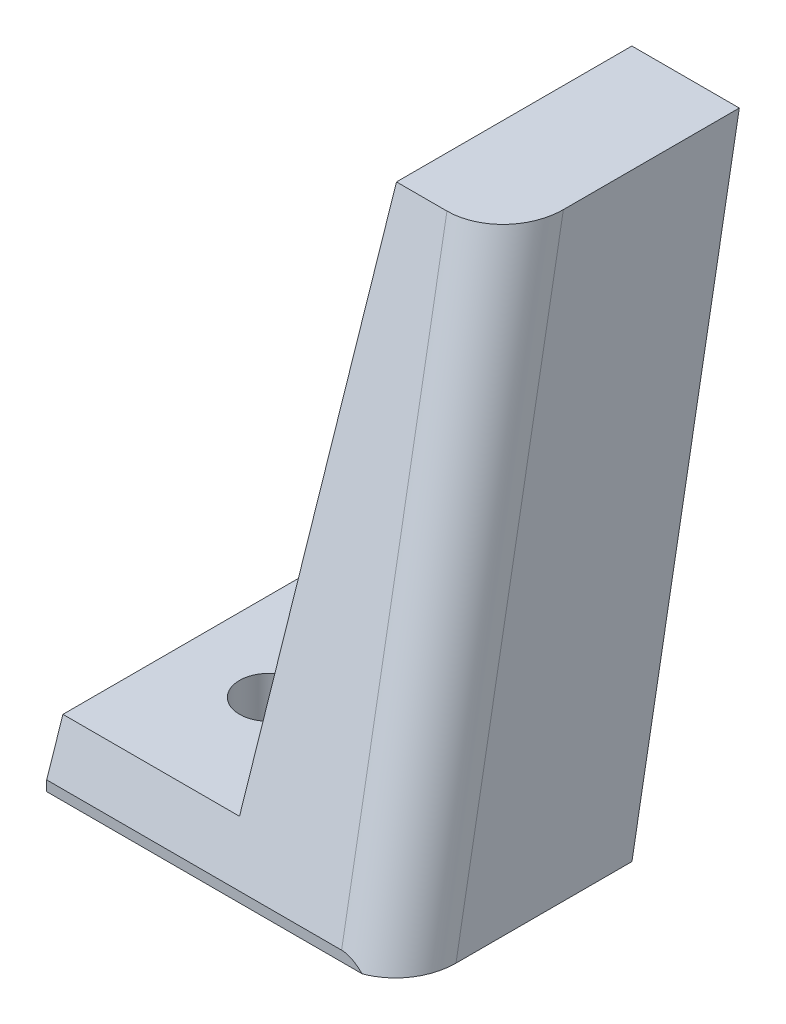
ISO-10303-21;
HEADER;
FILE_DESCRIPTION(('STEP AP214'),'2;1');
FILE_NAME('part.step','',(''),(''),'','','');
FILE_SCHEMA(('AUTOMOTIVE_DESIGN { 1 0 10303 214 1 1 1 1 }'));
ENDSEC;
DATA;
#1=APPLICATION_CONTEXT('core data for automotive mechanical design processes');
#2=APPLICATION_PROTOCOL_DEFINITION('international standard','automotive_design',2000,#1);
#3=PRODUCT_CONTEXT('',#1,'mechanical');
#4=PRODUCT('Part','Part','',(#3));
#5=PRODUCT_RELATED_PRODUCT_CATEGORY('part','',(#4));
#6=PRODUCT_DEFINITION_FORMATION('','',#4);
#7=PRODUCT_DEFINITION_CONTEXT('part definition',#1,'design');
#8=PRODUCT_DEFINITION('design','',#6,#7);
#9=PRODUCT_DEFINITION_SHAPE('','',#8);
#10=(LENGTH_UNIT() NAMED_UNIT(*) SI_UNIT(.MILLI.,.METRE.));
#11=(NAMED_UNIT(*) PLANE_ANGLE_UNIT() SI_UNIT($,.RADIAN.));
#12=(NAMED_UNIT(*) SI_UNIT($,.STERADIAN.) SOLID_ANGLE_UNIT());
#13=UNCERTAINTY_MEASURE_WITH_UNIT(LENGTH_MEASURE(1.E-05),#10,'distance_accuracy_value','');
#14=(GEOMETRIC_REPRESENTATION_CONTEXT(3) GLOBAL_UNCERTAINTY_ASSIGNED_CONTEXT((#13)) GLOBAL_UNIT_ASSIGNED_CONTEXT((#10,
#11,#12)) REPRESENTATION_CONTEXT('',''));
#15=CARTESIAN_POINT('',(0.,0.,0.));
#16=DIRECTION('',(0.,0.,1.));
#17=DIRECTION('',(1.,0.,0.));
#18=AXIS2_PLACEMENT_3D('',#15,#16,#17);
#19=CARTESIAN_POINT('',(38.4935772410488,11.2135474900435,41.2806580507196));
#20=DIRECTION('',(-0.122916675240222,0.941489427371918,-0.313829809123972));
#21=DIRECTION('',(0.,0.316227766016838,0.948683298050514));
#22=AXIS2_PLACEMENT_3D('',#19,#20,#21);
#23=CYLINDRICAL_SURFACE('',#22,5.);
#24=DIRECTION('',(-0.122916675240222,0.941489427371918,-0.313829809123972));
#25=VECTOR('',#24,1.);
#26=CARTESIAN_POINT('',(38.4935772410488,12.7946863201277,46.0240745409722));
#27=LINE('',#26,#25);
#28=CARTESIAN_POINT('',(40.0508147125013,0.866909943044204,50.));
#29=VERTEX_POINT('',#28);
#30=CARTESIAN_POINT('',(34.288994621709,45.0000000001769,35.2889699809558));
#31=VERTEX_POINT('',#30);
#32=EDGE_CURVE('E135',#29,#31,#27,.T.);
#33=ORIENTED_EDGE('',*,*,#32,.F.);
#34=CARTESIAN_POINT('',(41.9086528378502,-14.9444783577977,50.));
#35=DIRECTION('',(0.,0.,1.));
#36=DIRECTION('',(-0.12945693643977,0.991585045070583,0.));
#37=AXIS2_PLACEMENT_3D('',#34,#35,#36);
#38=ELLIPSE('',#37,15.9322022785441,5.);
#39=CARTESIAN_POINT('',(41.7980209045533,0.,50.));
#40=VERTEX_POINT('',#39);
#41=EDGE_CURVE('E43',#40,#29,#38,.T.);
#42=ORIENTED_EDGE('',*,*,#41,.F.);
#43=CARTESIAN_POINT('',(39.95756816336,0.,45.0185072140674));
#44=DIRECTION('',(0.,-1.,0.));
#45=DIRECTION('',(-0.364691898216784,0.,-0.931128250766262));
#46=AXIS2_PLACEMENT_3D('',#43,#44,#45);
#47=ELLIPSE('',#46,5.31073409284802,5.);
#48=CARTESIAN_POINT('',(45.,0.,45.2342687748004));
#49=VERTEX_POINT('',#48);
#50=EDGE_CURVE('E53',#49,#40,#47,.T.);
#51=ORIENTED_EDGE('',*,*,#50,.F.);
#52=DIRECTION('',(-0.122916675240222,0.941489427371917,-0.313829809123972));
#53=VECTOR('',#52,1.);
#54=CARTESIAN_POINT('',(44.5039547778189,3.79949531883381,43.9677703351891));
#55=LINE('',#54,#53);
#56=CARTESIAN_POINT('',(39.125,45.,30.2342687748004));
#57=VERTEX_POINT('',#56);
#58=EDGE_CURVE('E138',#57,#49,#55,.F.);
#59=ORIENTED_EDGE('',*,*,#58,.F.);
#60=CARTESIAN_POINT('',(34.08256816336,45.,30.0185072140675));
#61=DIRECTION('',(0.,1.,0.));
#62=DIRECTION('',(-0.364691898216784,0.,-0.931128250766262));
#63=AXIS2_PLACEMENT_3D('',#60,#61,#62);
#64=ELLIPSE('',#63,5.31073409284802,5.);
#65=EDGE_CURVE('E11',#31,#57,#64,.T.);
#66=ORIENTED_EDGE('',*,*,#65,.F.);
#67=EDGE_LOOP('',(#33,#42,#51,#59,#66));
#68=FACE_BOUND('',#67,.T.);
#69=ADVANCED_FACE('F36',(#68),#23,.T.);
#70=CARTESIAN_POINT('',(30.,0.,50.));
#71=DIRECTION('',(-1.,0.,0.));
#72=DIRECTION('',(0.,-1.,0.));
#73=AXIS2_PLACEMENT_3D('',#70,#71,#72);
#74=PLANE('',#73);
#75=DIRECTION('',(0.,0.,-1.));
#76=VECTOR('',#75,1.);
#77=CARTESIAN_POINT('',(30.,5.00000000008102,0.));
#78=LINE('',#77,#76);
#79=CARTESIAN_POINT('',(30.,5.00000000008103,48.6223033143211));
#80=VERTEX_POINT('',#79);
#81=CARTESIAN_POINT('',(30.,5.00000000008103,28.6227831519188));
#82=VERTEX_POINT('',#81);
#83=EDGE_CURVE('E119',#80,#82,#78,.T.);
#84=ORIENTED_EDGE('',*,*,#83,.F.);
#85=DIRECTION('',(0.,0.948683298050514,-0.316227766016838));
#86=VECTOR('',#85,1.);
#87=CARTESIAN_POINT('',(30.,0.0866909943044037,50.2600729829133));
#88=LINE('',#87,#86);
#89=CARTESIAN_POINT('',(30.,45.0000000001769,35.2889699809558));
#90=VERTEX_POINT('',#89);
#91=EDGE_CURVE('E124',#80,#90,#88,.T.);
#92=ORIENTED_EDGE('',*,*,#91,.T.);
#93=DIRECTION('',(0.,0.,-1.));
#94=VECTOR('',#93,1.);
#95=CARTESIAN_POINT('',(30.,45.,50.));
#96=LINE('',#95,#94);
#97=CARTESIAN_POINT('',(30.,45.0000000001769,15.2932885193357));
#98=VERTEX_POINT('',#97);
#99=EDGE_CURVE('E166',#90,#98,#96,.T.);
#100=ORIENTED_EDGE('',*,*,#99,.T.);
#101=DIRECTION('',(0.,0.948710608132915,-0.316145823973803));
#102=VECTOR('',#101,1.);
#103=CARTESIAN_POINT('',(30.,-5.91194691282842,32.2590515970766));
#104=LINE('',#103,#102);
#105=EDGE_CURVE('E152',#82,#98,#104,.T.);
#106=ORIENTED_EDGE('',*,*,#105,.F.);
#107=EDGE_LOOP('',(#84,#92,#100,#106));
#108=FACE_BOUND('',#107,.T.);
#109=ADVANCED_FACE('F212',(#108),#74,.T.);
#110=CARTESIAN_POINT('',(44.2458405723433,5.77654029694479,50.));
#111=DIRECTION('',(0.991585045070583,0.12945693643977,0.));
#112=DIRECTION('',(-0.12945693643977,0.991585045070583,0.));
#113=AXIS2_PLACEMENT_3D('',#110,#111,#112);
#114=PLANE('',#113);
#115=DIRECTION('',(0.,0.,-1.));
#116=VECTOR('',#115,1.);
#117=CARTESIAN_POINT('',(39.125,45.,50.));
#118=LINE('',#117,#116);
#119=CARTESIAN_POINT('',(39.125,45.0000000001769,15.2932885193357));
#120=VERTEX_POINT('',#119);
#121=EDGE_CURVE('E148',#57,#120,#118,.T.);
#122=ORIENTED_EDGE('',*,*,#121,.F.);
#123=ORIENTED_EDGE('',*,*,#58,.T.);
#124=DIRECTION('',(0.,0.,-1.));
#125=VECTOR('',#124,1.);
#126=CARTESIAN_POINT('',(45.,0.,50.));
#127=LINE('',#126,#125);
#128=CARTESIAN_POINT('',(45.,0.,30.2889699810147));
#129=VERTEX_POINT('',#128);
#130=EDGE_CURVE('E146',#49,#129,#127,.T.);
#131=ORIENTED_EDGE('',*,*,#130,.T.);
#132=DIRECTION('',(0.122920160223209,-0.94151612085863,0.313748351986139));
#133=VECTOR('',#132,1.);
#134=CARTESIAN_POINT('',(45.0802540777776,-0.614712085105079,30.493815016989));
#135=LINE('',#134,#133);
#136=EDGE_CURVE('E156',#120,#129,#135,.T.);
#137=ORIENTED_EDGE('',*,*,#136,.F.);
#138=EDGE_LOOP('',(#122,#123,#131,#137));
#139=FACE_BOUND('',#138,.T.);
#140=ADVANCED_FACE('F180',(#139),#114,.T.);
#141=CARTESIAN_POINT('',(0.,45.,50.));
#142=DIRECTION('',(0.,1.,0.));
#143=DIRECTION('',(0.,0.,1.));
#144=AXIS2_PLACEMENT_3D('',#141,#142,#143);
#145=PLANE('',#144);
#146=DIRECTION('',(-1.,0.,0.));
#147=VECTOR('',#146,1.);
#148=CARTESIAN_POINT('',(58.,45.0000000001769,35.2889699809558));
#149=LINE('',#148,#147);
#150=EDGE_CURVE('E155',#31,#90,#149,.T.);
#151=ORIENTED_EDGE('',*,*,#150,.F.);
#152=ORIENTED_EDGE('',*,*,#65,.T.);
#153=ORIENTED_EDGE('',*,*,#121,.T.);
#154=DIRECTION('',(-1.,0.,0.));
#155=VECTOR('',#154,1.);
#156=CARTESIAN_POINT('',(58.,45.0000000001769,15.2932885193357));
#157=LINE('',#156,#155);
#158=EDGE_CURVE('E127',#120,#98,#157,.T.);
#159=ORIENTED_EDGE('',*,*,#158,.T.);
#160=ORIENTED_EDGE('',*,*,#99,.F.);
#161=EDGE_LOOP('',(#151,#152,#153,#159,#160));
#162=FACE_BOUND('',#161,.T.);
#163=ADVANCED_FACE('F172',(#162),#145,.T.);
#164=CARTESIAN_POINT('',(0.,0.,50.));
#165=DIRECTION('',(0.,0.,1.));
#166=DIRECTION('',(1.,0.,0.));
#167=AXIS2_PLACEMENT_3D('',#164,#165,#166);
#168=PLANE('',#167);
#169=DIRECTION('',(-1.,0.,0.));
#170=VECTOR('',#169,1.);
#171=CARTESIAN_POINT('',(0.,0.,50.));
#172=LINE('',#171,#170);
#173=CARTESIAN_POINT('',(15.,0.,50.));
#174=VERTEX_POINT('',#173);
#175=EDGE_CURVE('E144',#40,#174,#172,.T.);
#176=ORIENTED_EDGE('',*,*,#175,.F.);
#177=ORIENTED_EDGE('',*,*,#41,.T.);
#178=DIRECTION('',(-1.,0.,0.));
#179=VECTOR('',#178,1.);
#180=CARTESIAN_POINT('',(0.,0.866909943044204,50.));
#181=LINE('',#180,#179);
#182=CARTESIAN_POINT('',(15.,0.866909943044203,50.));
#183=VERTEX_POINT('',#182);
#184=EDGE_CURVE('E139',#29,#183,#181,.T.);
#185=ORIENTED_EDGE('',*,*,#184,.T.);
#186=DIRECTION('',(0.,1.,0.));
#187=VECTOR('',#186,1.);
#188=CARTESIAN_POINT('',(15.,0.,50.));
#189=LINE('',#188,#187);
#190=EDGE_CURVE('E116',#174,#183,#189,.T.);
#191=ORIENTED_EDGE('',*,*,#190,.F.);
#192=EDGE_LOOP('',(#176,#177,#185,#191));
#193=FACE_BOUND('',#192,.T.);
#194=ADVANCED_FACE('F143',(#193),#168,.T.);
#195=CARTESIAN_POINT('',(0.,0.,50.));
#196=DIRECTION('',(0.,-1.,0.));
#197=DIRECTION('',(1.,0.,0.));
#198=AXIS2_PLACEMENT_3D('',#195,#196,#197);
#199=PLANE('',#198);
#200=CARTESIAN_POINT('',(22.5,0.,38.62254323312));
#201=DIRECTION('',(0.,-1.,0.));
#202=DIRECTION('',(1.,0.,0.));
#203=AXIS2_PLACEMENT_3D('',#200,#201,#202);
#204=CIRCLE('',#203,2.5);
#205=CARTESIAN_POINT('',(25.,0.,38.62254323312));
#206=VERTEX_POINT('',#205);
#207=EDGE_CURVE('E191',#206,#206,#204,.T.);
#208=ORIENTED_EDGE('',*,*,#207,.F.);
#209=EDGE_LOOP('',(#208));
#210=FACE_BOUND('',#209,.T.);
#211=ORIENTED_EDGE('',*,*,#130,.F.);
#212=ORIENTED_EDGE('',*,*,#50,.T.);
#213=ORIENTED_EDGE('',*,*,#175,.T.);
#214=DIRECTION('',(0.,0.,1.));
#215=VECTOR('',#214,1.);
#216=CARTESIAN_POINT('',(15.,0.,0.));
#217=LINE('',#216,#215);
#218=CARTESIAN_POINT('',(15.,0.,30.2889699810147));
#219=VERTEX_POINT('',#218);
#220=EDGE_CURVE('E185',#219,#174,#217,.T.);
#221=ORIENTED_EDGE('',*,*,#220,.F.);
#222=DIRECTION('',(-1.,0.,0.));
#223=VECTOR('',#222,1.);
#224=CARTESIAN_POINT('',(58.,0.,30.2889699810147));
#225=LINE('',#224,#223);
#226=EDGE_CURVE('E125',#129,#219,#225,.T.);
#227=ORIENTED_EDGE('',*,*,#226,.F.);
#228=EDGE_LOOP('',(#211,#212,#213,#221,#227));
#229=FACE_BOUND('',#228,.T.);
#230=ADVANCED_FACE('F183',(#210,#229),#199,.T.);
#231=CARTESIAN_POINT('',(58.,15.0866909943044,45.2600729829133));
#232=DIRECTION('',(0.,0.316227766016838,0.948683298050514));
#233=DIRECTION('',(0.,-0.948683298050514,0.316227766016838));
#234=AXIS2_PLACEMENT_3D('',#231,#232,#233);
#235=PLANE('',#234);
#236=ORIENTED_EDGE('',*,*,#184,.F.);
#237=ORIENTED_EDGE('',*,*,#32,.T.);
#238=ORIENTED_EDGE('',*,*,#150,.T.);
#239=ORIENTED_EDGE('',*,*,#91,.F.);
#240=DIRECTION('',(1.,0.,0.));
#241=VECTOR('',#240,1.);
#242=CARTESIAN_POINT('',(15.,5.00000000008103,48.6223033143211));
#243=LINE('',#242,#241);
#244=CARTESIAN_POINT('',(15.,5.00000000008103,48.6223033143211));
#245=VERTEX_POINT('',#244);
#246=EDGE_CURVE('E102',#245,#80,#243,.T.);
#247=ORIENTED_EDGE('',*,*,#246,.F.);
#248=DIRECTION('',(0.,0.948683298050514,-0.316227766016838));
#249=VECTOR('',#248,1.);
#250=CARTESIAN_POINT('',(15.,15.0866909943044,45.2600729829133));
#251=LINE('',#250,#249);
#252=EDGE_CURVE('E109',#183,#245,#251,.T.);
#253=ORIENTED_EDGE('',*,*,#252,.F.);
#254=EDGE_LOOP('',(#236,#237,#238,#239,#247,#253));
#255=FACE_BOUND('',#254,.T.);
#256=ADVANCED_FACE('F122',(#255),#235,.T.);
#257=CARTESIAN_POINT('',(58.,9.08459793321499,27.2616424962729));
#258=DIRECTION('',(0.,0.316145823973803,0.948710608132915));
#259=DIRECTION('',(0.,-0.948710608132915,0.316145823973803));
#260=AXIS2_PLACEMENT_3D('',#257,#258,#259);
#261=PLANE('',#260);
#262=ORIENTED_EDGE('',*,*,#226,.T.);
#263=DIRECTION('',(0.,-0.948710608132915,0.316145823973803));
#264=VECTOR('',#263,1.);
#265=CARTESIAN_POINT('',(15.,9.08459793321499,27.2616424962729));
#266=LINE('',#265,#264);
#267=CARTESIAN_POINT('',(15.,5.00000000008103,28.6227831519188));
#268=VERTEX_POINT('',#267);
#269=EDGE_CURVE('E108',#268,#219,#266,.T.);
#270=ORIENTED_EDGE('',*,*,#269,.F.);
#271=DIRECTION('',(1.,0.,0.));
#272=VECTOR('',#271,1.);
#273=CARTESIAN_POINT('',(15.,5.00000000008103,28.6227831519188));
#274=LINE('',#273,#272);
#275=EDGE_CURVE('E104',#268,#82,#274,.T.);
#276=ORIENTED_EDGE('',*,*,#275,.T.);
#277=ORIENTED_EDGE('',*,*,#105,.T.);
#278=ORIENTED_EDGE('',*,*,#158,.F.);
#279=ORIENTED_EDGE('',*,*,#136,.T.);
#280=EDGE_LOOP('',(#262,#270,#276,#277,#278,#279));
#281=FACE_BOUND('',#280,.T.);
#282=ADVANCED_FACE('F178',(#281),#261,.F.);
#283=CARTESIAN_POINT('',(15.,5.00000000008102,0.));
#284=DIRECTION('',(0.,-1.,0.));
#285=DIRECTION('',(0.,0.,-1.));
#286=AXIS2_PLACEMENT_3D('',#283,#284,#285);
#287=PLANE('',#286);
#288=CARTESIAN_POINT('',(22.5,5.00000000008103,38.62254323312));
#289=DIRECTION('',(0.,1.,0.));
#290=DIRECTION('',(0.,0.,1.));
#291=AXIS2_PLACEMENT_3D('',#288,#289,#290);
#292=CIRCLE('',#291,2.5);
#293=CARTESIAN_POINT('',(22.5,5.00000000008103,41.12254323312));
#294=VERTEX_POINT('',#293);
#295=EDGE_CURVE('E193',#294,#294,#292,.T.);
#296=ORIENTED_EDGE('',*,*,#295,.F.);
#297=EDGE_LOOP('',(#296));
#298=FACE_BOUND('',#297,.T.);
#299=ORIENTED_EDGE('',*,*,#83,.T.);
#300=ORIENTED_EDGE('',*,*,#275,.F.);
#301=DIRECTION('',(0.,0.,-1.));
#302=VECTOR('',#301,1.);
#303=CARTESIAN_POINT('',(15.,5.00000000008102,0.));
#304=LINE('',#303,#302);
#305=EDGE_CURVE('E97',#245,#268,#304,.T.);
#306=ORIENTED_EDGE('',*,*,#305,.F.);
#307=ORIENTED_EDGE('',*,*,#246,.T.);
#308=EDGE_LOOP('',(#299,#300,#306,#307));
#309=FACE_BOUND('',#308,.T.);
#310=ADVANCED_FACE('F100',(#298,#309),#287,.F.);
#311=CARTESIAN_POINT('',(15.,0.,0.));
#312=DIRECTION('',(-1.,0.,0.));
#313=DIRECTION('',(0.,0.,1.));
#314=AXIS2_PLACEMENT_3D('',#311,#312,#313);
#315=PLANE('',#314);
#316=ORIENTED_EDGE('',*,*,#252,.T.);
#317=ORIENTED_EDGE('',*,*,#305,.T.);
#318=ORIENTED_EDGE('',*,*,#269,.T.);
#319=ORIENTED_EDGE('',*,*,#220,.T.);
#320=ORIENTED_EDGE('',*,*,#190,.T.);
#321=EDGE_LOOP('',(#316,#317,#318,#319,#320));
#322=FACE_BOUND('',#321,.T.);
#323=ADVANCED_FACE('F113',(#322),#315,.T.);
#324=CARTESIAN_POINT('',(22.5,-9.99999999991897,38.62254323312));
#325=DIRECTION('',(0.,1.,0.));
#326=DIRECTION('',(0.,0.,1.));
#327=AXIS2_PLACEMENT_3D('',#324,#325,#326);
#328=CYLINDRICAL_SURFACE('',#327,2.5);
#329=ORIENTED_EDGE('',*,*,#207,.T.);
#330=EDGE_LOOP('',(#329));
#331=FACE_BOUND('',#330,.T.);
#332=ORIENTED_EDGE('',*,*,#295,.T.);
#333=EDGE_LOOP('',(#332));
#334=FACE_BOUND('',#333,.T.);
#335=ADVANCED_FACE('F201',(#331,#334),#328,.F.);
#336=CLOSED_SHELL('',(#69,#109,#140,#163,#194,#230,#256,#282,#310,#323,#335));
#337=MANIFOLD_SOLID_BREP('B2',#336);
#338=ADVANCED_BREP_SHAPE_REPRESENTATION('',(#18,#337),#14);
#339=SHAPE_DEFINITION_REPRESENTATION(#9,#338);
ENDSEC;
END-ISO-10303-21;
